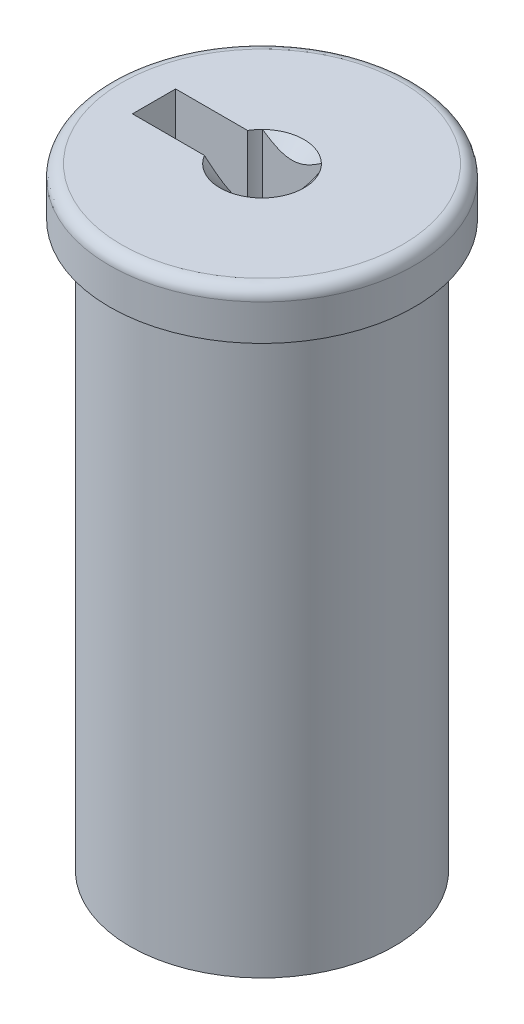
ISO-10303-21;
HEADER;
FILE_DESCRIPTION(('STEP AP214'),'2;1');
FILE_NAME('part.step','',(''),(''),'','','');
FILE_SCHEMA(('AUTOMOTIVE_DESIGN { 1 0 10303 214 1 1 1 1 }'));
ENDSEC;
DATA;
#1=APPLICATION_CONTEXT('core data for automotive mechanical design processes');
#2=APPLICATION_PROTOCOL_DEFINITION('international standard','automotive_design',2000,#1);
#3=PRODUCT_CONTEXT('',#1,'mechanical');
#4=PRODUCT('Part','Part','',(#3));
#5=PRODUCT_RELATED_PRODUCT_CATEGORY('part','',(#4));
#6=PRODUCT_DEFINITION_FORMATION('','',#4);
#7=PRODUCT_DEFINITION_CONTEXT('part definition',#1,'design');
#8=PRODUCT_DEFINITION('design','',#6,#7);
#9=PRODUCT_DEFINITION_SHAPE('','',#8);
#10=(LENGTH_UNIT() NAMED_UNIT(*) SI_UNIT(.MILLI.,.METRE.));
#11=(NAMED_UNIT(*) PLANE_ANGLE_UNIT() SI_UNIT($,.RADIAN.));
#12=(NAMED_UNIT(*) SI_UNIT($,.STERADIAN.) SOLID_ANGLE_UNIT());
#13=UNCERTAINTY_MEASURE_WITH_UNIT(LENGTH_MEASURE(1.E-05),#10,'distance_accuracy_value','');
#14=(GEOMETRIC_REPRESENTATION_CONTEXT(3) GLOBAL_UNCERTAINTY_ASSIGNED_CONTEXT((#13)) GLOBAL_UNIT_ASSIGNED_CONTEXT((#10,
#11,#12)) REPRESENTATION_CONTEXT('',''));
#15=CARTESIAN_POINT('',(0.,0.,0.));
#16=DIRECTION('',(0.,0.,1.));
#17=DIRECTION('',(1.,0.,0.));
#18=AXIS2_PLACEMENT_3D('',#15,#16,#17);
#19=CARTESIAN_POINT('',(0.,1.99685534591195,0.));
#20=DIRECTION('',(0.,1.,0.));
#21=DIRECTION('',(0.,0.,1.));
#22=AXIS2_PLACEMENT_3D('',#19,#20,#21);
#23=PLANE('',#22);
#24=CARTESIAN_POINT('',(0.,1.99685534591195,0.));
#25=DIRECTION('',(0.,1.,0.));
#26=DIRECTION('',(0.,0.,1.));
#27=AXIS2_PLACEMENT_3D('',#24,#25,#26);
#28=CIRCLE('',#27,1.75);
#29=CARTESIAN_POINT('',(1.22474487139159,1.99685534591195,-1.25));
#30=VERTEX_POINT('',#29);
#31=CARTESIAN_POINT('',(-1.22474487139159,1.99685534591195,-1.25));
#32=VERTEX_POINT('',#31);
#33=EDGE_CURVE('E265',#30,#32,#28,.T.);
#34=ORIENTED_EDGE('',*,*,#33,.F.);
#35=CARTESIAN_POINT('',(0.,1.99685534591195,0.));
#36=DIRECTION('',(0.,1.,0.));
#37=DIRECTION('',(0.,0.,1.));
#38=AXIS2_PLACEMENT_3D('',#35,#36,#37);
#39=CIRCLE('',#38,1.75);
#40=CARTESIAN_POINT('',(1.50083310198036,1.99685534591195,-0.9));
#41=VERTEX_POINT('',#40);
#42=EDGE_CURVE('E155',#41,#30,#39,.T.);
#43=ORIENTED_EDGE('',*,*,#42,.F.);
#44=CARTESIAN_POINT('',(1.50083310198036,1.99685534591195,0.899999999999998));
#45=VERTEX_POINT('',#44);
#46=EDGE_CURVE('E264',#45,#41,#28,.T.);
#47=ORIENTED_EDGE('',*,*,#46,.F.);
#48=CARTESIAN_POINT('',(-1.50083310198036,1.99685534591195,0.9));
#49=VERTEX_POINT('',#48);
#50=EDGE_CURVE('E266',#49,#45,#28,.T.);
#51=ORIENTED_EDGE('',*,*,#50,.F.);
#52=DIRECTION('',(-1.,0.,0.));
#53=VECTOR('',#52,1.);
#54=CARTESIAN_POINT('',(0.,1.99685534591195,0.899999999999999));
#55=LINE('',#54,#53);
#56=CARTESIAN_POINT('',(-4.49916689801964,1.99685534591195,0.900000000000001));
#57=VERTEX_POINT('',#56);
#58=EDGE_CURVE('E98',#49,#57,#55,.T.);
#59=ORIENTED_EDGE('',*,*,#58,.T.);
#60=DIRECTION('',(0.,0.,-1.));
#61=VECTOR('',#60,1.);
#62=CARTESIAN_POINT('',(-4.49916689801964,1.99685534591195,0.));
#63=LINE('',#62,#61);
#64=CARTESIAN_POINT('',(-4.49916689801964,1.99685534591195,-0.900000000000001));
#65=VERTEX_POINT('',#64);
#66=EDGE_CURVE('E160',#57,#65,#63,.T.);
#67=ORIENTED_EDGE('',*,*,#66,.T.);
#68=DIRECTION('',(1.,0.,0.));
#69=VECTOR('',#68,1.);
#70=CARTESIAN_POINT('',(0.,1.99685534591195,-0.899999999999998));
#71=LINE('',#70,#69);
#72=CARTESIAN_POINT('',(-1.50083310198036,1.99685534591195,-0.899999999999999));
#73=VERTEX_POINT('',#72);
#74=EDGE_CURVE('E140',#65,#73,#71,.T.);
#75=ORIENTED_EDGE('',*,*,#74,.T.);
#76=EDGE_CURVE('E158',#32,#73,#39,.T.);
#77=ORIENTED_EDGE('',*,*,#76,.F.);
#78=EDGE_LOOP('',(#34,#43,#47,#51,#59,#67,#75,#77));
#79=FACE_BOUND('',#78,.T.);
#80=CARTESIAN_POINT('',(0.,1.99685534591195,0.));
#81=DIRECTION('',(0.,1.,0.));
#82=DIRECTION('',(0.,0.,1.));
#83=AXIS2_PLACEMENT_3D('',#80,#81,#82);
#84=CIRCLE('',#83,5.85);
#85=CARTESIAN_POINT('',(0.,1.99685534591195,5.85));
#86=VERTEX_POINT('',#85);
#87=EDGE_CURVE('E69',#86,#86,#84,.T.);
#88=ORIENTED_EDGE('',*,*,#87,.T.);
#89=EDGE_LOOP('',(#88));
#90=FACE_BOUND('',#89,.T.);
#91=ADVANCED_FACE('F60',(#79,#90),#23,.T.);
#92=CARTESIAN_POINT('',(0.,0.,0.));
#93=DIRECTION('',(0.,1.,0.));
#94=DIRECTION('',(0.,0.,1.));
#95=AXIS2_PLACEMENT_3D('',#92,#93,#94);
#96=CYLINDRICAL_SURFACE('',#95,6.35);
#97=CARTESIAN_POINT('',(0.,1.49685534591195,0.));
#98=DIRECTION('',(0.,1.,0.));
#99=DIRECTION('',(0.,0.,1.));
#100=AXIS2_PLACEMENT_3D('',#97,#98,#99);
#101=CIRCLE('',#100,6.35);
#102=CARTESIAN_POINT('',(0.,1.49685534591195,6.35));
#103=VERTEX_POINT('',#102);
#104=EDGE_CURVE('E12',#103,#103,#101,.F.);
#105=ORIENTED_EDGE('',*,*,#104,.T.);
#106=EDGE_LOOP('',(#105));
#107=FACE_BOUND('',#106,.T.);
#108=CARTESIAN_POINT('',(0.,0.,0.));
#109=DIRECTION('',(0.,1.,0.));
#110=DIRECTION('',(0.,0.,1.));
#111=AXIS2_PLACEMENT_3D('',#108,#109,#110);
#112=CIRCLE('',#111,6.35);
#113=CARTESIAN_POINT('',(0.,0.,6.35));
#114=VERTEX_POINT('',#113);
#115=EDGE_CURVE('E179',#114,#114,#112,.T.);
#116=ORIENTED_EDGE('',*,*,#115,.T.);
#117=EDGE_LOOP('',(#116));
#118=FACE_BOUND('',#117,.T.);
#119=ADVANCED_FACE('F203',(#107,#118),#96,.T.);
#120=CARTESIAN_POINT('',(6.35,0.,0.));
#121=DIRECTION('',(0.,-1.,0.));
#122=DIRECTION('',(0.,0.,-1.));
#123=AXIS2_PLACEMENT_3D('',#120,#121,#122);
#124=PLANE('',#123);
#125=CARTESIAN_POINT('',(0.,0.,0.));
#126=DIRECTION('',(0.,-1.,0.));
#127=DIRECTION('',(0.,0.,-1.));
#128=AXIS2_PLACEMENT_3D('',#125,#126,#127);
#129=CIRCLE('',#128,5.5);
#130=CARTESIAN_POINT('',(0.,0.,-5.5));
#131=VERTEX_POINT('',#130);
#132=EDGE_CURVE('E180',#131,#131,#129,.T.);
#133=ORIENTED_EDGE('',*,*,#132,.F.);
#134=EDGE_LOOP('',(#133));
#135=FACE_BOUND('',#134,.T.);
#136=ORIENTED_EDGE('',*,*,#115,.F.);
#137=EDGE_LOOP('',(#136));
#138=FACE_BOUND('',#137,.T.);
#139=ADVANCED_FACE('F208',(#135,#138),#124,.T.);
#140=CARTESIAN_POINT('',(0.,-23.5,0.));
#141=DIRECTION('',(0.,1.,0.));
#142=DIRECTION('',(0.,0.,1.));
#143=AXIS2_PLACEMENT_3D('',#140,#141,#142);
#144=CYLINDRICAL_SURFACE('',#143,5.5);
#145=CARTESIAN_POINT('',(0.,-23.5,0.));
#146=DIRECTION('',(0.,-1.,0.));
#147=DIRECTION('',(0.,0.,-1.));
#148=AXIS2_PLACEMENT_3D('',#145,#146,#147);
#149=CIRCLE('',#148,5.5);
#150=CARTESIAN_POINT('',(0.,-23.5,-5.5));
#151=VERTEX_POINT('',#150);
#152=EDGE_CURVE('E167',#151,#151,#149,.T.);
#153=ORIENTED_EDGE('',*,*,#152,.F.);
#154=EDGE_LOOP('',(#153));
#155=FACE_BOUND('',#154,.T.);
#156=ORIENTED_EDGE('',*,*,#132,.T.);
#157=EDGE_LOOP('',(#156));
#158=FACE_BOUND('',#157,.T.);
#159=ADVANCED_FACE('F213',(#155,#158),#144,.T.);
#160=CARTESIAN_POINT('',(0.,-23.5,0.));
#161=DIRECTION('',(0.,-1.,0.));
#162=DIRECTION('',(0.,0.,-1.));
#163=AXIS2_PLACEMENT_3D('',#160,#161,#162);
#164=PLANE('',#163);
#165=ORIENTED_EDGE('',*,*,#152,.T.);
#166=EDGE_LOOP('',(#165));
#167=FACE_BOUND('',#166,.T.);
#168=ADVANCED_FACE('F220',(#167),#164,.T.);
#169=CARTESIAN_POINT('',(1.50083310198036,-8.00314465408805,0.));
#170=DIRECTION('',(-1.,0.,0.));
#171=DIRECTION('',(0.,0.,1.));
#172=AXIS2_PLACEMENT_3D('',#169,#170,#171);
#173=PLANE('',#172);
#174=CARTESIAN_POINT('',(1.50083310198036,2.58102767974036,-1.78769697768105));
#175=CARTESIAN_POINT('',(1.50083310198036,2.54789201782998,-1.74442569699751));
#176=CARTESIAN_POINT('',(1.50083310198036,2.5150635177435,-1.70091992350826));
#177=CARTESIAN_POINT('',(1.50083310198036,2.45014940518146,-1.61334201639202));
#178=CARTESIAN_POINT('',(1.50083310198036,2.41806397303119,-1.56926974924291));
#179=CARTESIAN_POINT('',(1.50083310198036,2.32265706334548,-1.43541233804854));
#180=CARTESIAN_POINT('',(1.50083310198036,2.26069396993077,-1.34464298655783));
#181=CARTESIAN_POINT('',(1.50083310198036,2.13849213576003,-1.15390873630126));
#182=CARTESIAN_POINT('',(1.50083310198036,2.07859583984592,-1.05372205666954));
#183=CARTESIAN_POINT('',(1.50083310198036,1.96864537543266,-0.848271443774003));
#184=CARTESIAN_POINT('',(1.50083310198036,1.9185579727457,-0.743026214468439));
#185=CARTESIAN_POINT('',(1.50083310198036,1.85726382496891,-0.585611147048519));
#186=CARTESIAN_POINT('',(1.50083310198036,1.83977595311796,-0.535899355739226));
#187=CARTESIAN_POINT('',(1.50083310198036,1.80878492898886,-0.435223564090527));
#188=CARTESIAN_POINT('',(1.50083310198036,1.79528203542052,-0.384259482683437));
#189=CARTESIAN_POINT('',(1.50083310198036,1.77320564443161,-0.28226476229586));
#190=CARTESIAN_POINT('',(1.50083310198036,1.76454393137995,-0.231253529087822));
#191=CARTESIAN_POINT('',(1.50083310198036,1.75232878444633,-0.128619538401874));
#192=CARTESIAN_POINT('',(1.50083310198036,1.74877433974499,-0.0769969039709247));
#193=CARTESIAN_POINT('',(1.50083310198036,1.74706636293139,0.0241843737507768));
#194=CARTESIAN_POINT('',(1.50083310198036,1.74869391000862,0.0737393704966389));
#195=CARTESIAN_POINT('',(1.50083310198036,1.75676224665262,0.172453125815203));
#196=CARTESIAN_POINT('',(1.50083310198036,1.76320348170739,0.221611847288537));
#197=CARTESIAN_POINT('',(1.50083310198036,1.7806472426943,0.320010772845203));
#198=CARTESIAN_POINT('',(1.50083310198036,1.79172954519245,0.369236609505007));
#199=CARTESIAN_POINT('',(1.50083310198036,1.81784861115949,0.466604319118156));
#200=CARTESIAN_POINT('',(1.50083310198036,1.83288512212274,0.51474626107321));
#201=CARTESIAN_POINT('',(1.50083310198036,1.88514037878449,0.66371562404398));
#202=CARTESIAN_POINT('',(1.50083310198036,1.92820030629378,0.762488201091973));
#203=CARTESIAN_POINT('',(1.50083310198036,2.02400555067697,0.955414306827815));
#204=CARTESIAN_POINT('',(1.50083310198036,2.07678515103549,1.04954994155055));
#205=CARTESIAN_POINT('',(1.50083310198036,2.18574561831869,1.22948936467362));
#206=CARTESIAN_POINT('',(1.50083310198036,2.24162987345261,1.31547504522854));
#207=CARTESIAN_POINT('',(1.50083310198036,2.32805239010938,1.44215687848311));
#208=CARTESIAN_POINT('',(1.50083310198036,2.3571707307896,1.48383880838493));
#209=CARTESIAN_POINT('',(1.50083310198036,2.41618573043119,1.56663130540246));
#210=CARTESIAN_POINT('',(1.50083310198036,2.44608217271215,1.60774202679509));
#211=CARTESIAN_POINT('',(1.50083310198036,2.47630150794565,1.64861462731798));
#212=B_SPLINE_CURVE_WITH_KNOTS('',3,(#174,#175,#176,#177,#178,#179,#180,#181,#182,#183,#184,
#185,#186,#187,#188,#189,#190,#191,#192,#193,#194,#195,#196,#197,#198,#199,#200,#201,#202,#203,
#204,#205,#206,#207,#208,#209,#210,#211),.UNSPECIFIED.,.F.,.F.,(4,2,2,2,2,2,2,2,2,2,2,2,2,2,2,2,
2,2,4),(0.,0.163499475188371,0.327038220710081,0.656606203121994,1.00651435366872,
1.3552156267395,1.51317749463113,1.67114961535181,1.82614058790741,1.98110088076134,
2.12960286469262,2.27811859360367,2.42929938332605,2.58047052137383,2.9027796464659,
3.22624819538202,3.53374535846932,3.6862757947348,3.83876420048568),.UNSPECIFIED.);
#213=EDGE_CURVE('E105',#41,#45,#212,.T.);
#214=ORIENTED_EDGE('',*,*,#213,.F.);
#215=DIRECTION('',(0.,1.,0.));
#216=VECTOR('',#215,1.);
#217=CARTESIAN_POINT('',(1.50083310198036,-8.00314465408805,-0.9));
#218=LINE('',#217,#216);
#219=CARTESIAN_POINT('',(1.50083310198036,-8.00314465408805,-0.9));
#220=VERTEX_POINT('',#219);
#221=EDGE_CURVE('E112',#220,#41,#218,.T.);
#222=ORIENTED_EDGE('',*,*,#221,.F.);
#223=DIRECTION('',(0.,0.,1.));
#224=VECTOR('',#223,1.);
#225=CARTESIAN_POINT('',(1.50083310198036,-8.00314465408805,0.));
#226=LINE('',#225,#224);
#227=CARTESIAN_POINT('',(1.50083310198036,-8.00314465408805,0.899999999999998));
#228=VERTEX_POINT('',#227);
#229=EDGE_CURVE('E163',#220,#228,#226,.T.);
#230=ORIENTED_EDGE('',*,*,#229,.T.);
#231=DIRECTION('',(0.,1.,0.));
#232=VECTOR('',#231,1.);
#233=CARTESIAN_POINT('',(1.50083310198036,-8.00314465408805,0.899999999999998));
#234=LINE('',#233,#232);
#235=EDGE_CURVE('E164',#228,#45,#234,.T.);
#236=ORIENTED_EDGE('',*,*,#235,.T.);
#237=EDGE_LOOP('',(#214,#222,#230,#236));
#238=FACE_BOUND('',#237,.T.);
#239=ADVANCED_FACE('F230',(#238),#173,.T.);
#240=CARTESIAN_POINT('',(0.,-8.00314465408805,0.899999999999999));
#241=DIRECTION('',(0.,0.,-1.));
#242=DIRECTION('',(-1.,0.,0.));
#243=AXIS2_PLACEMENT_3D('',#240,#241,#242);
#244=PLANE('',#243);
#245=CARTESIAN_POINT('',(-6.57315509084369,6.88133858489026,0.900000000000002));
#246=CARTESIAN_POINT('',(-6.39296646193386,6.70282093423535,0.900000000000002));
#247=CARTESIAN_POINT('',(-6.21271543673626,6.52436620026066,0.900000000000002));
#248=CARTESIAN_POINT('',(-5.85197899744231,6.16757599316444,0.900000000000002));
#249=CARTESIAN_POINT('',(-5.67149352604317,5.989240577985,0.900000000000002));
#250=CARTESIAN_POINT('',(-5.30919077447101,5.63170820979137,0.900000000000002));
#251=CARTESIAN_POINT('',(-5.12737210421338,5.4525126645303,0.900000000000002));
#252=CARTESIAN_POINT('',(-4.76347726788477,5.09450103057511,0.900000000000001));
#253=CARTESIAN_POINT('',(-4.58140120393365,4.91568483802606,0.900000000000001));
#254=CARTESIAN_POINT('',(-4.11999138147013,4.46362030270415,0.900000000000001));
#255=CARTESIAN_POINT('',(-3.84036961544061,4.19066504403834,0.900000000000001));
#256=CARTESIAN_POINT('',(-3.41936537995554,3.78251767913426,0.900000000000001));
#257=CARTESIAN_POINT('',(-3.27868447540995,3.64660227291807,0.900000000000001));
#258=CARTESIAN_POINT('',(-2.99665661438537,3.37550070157014,0.9));
#259=CARTESIAN_POINT('',(-2.8553097494113,3.24031444142851,0.9));
#260=CARTESIAN_POINT('',(-2.572338657503,2.97173229807433,0.9));
#261=CARTESIAN_POINT('',(-2.43071982792858,2.83833073201646,0.9));
#262=CARTESIAN_POINT('',(-2.14581021406694,2.57316677299582,0.9));
#263=CARTESIAN_POINT('',(-2.00251861875808,2.44140524508687,0.9));
#264=CARTESIAN_POINT('',(-1.7856380246076,2.24623934818881,0.9));
#265=CARTESIAN_POINT('',(-1.71310198659393,2.1816668918955,0.9));
#266=CARTESIAN_POINT('',(-1.56706055161221,2.05362986430545,0.9));
#267=CARTESIAN_POINT('',(-1.49355520402746,1.99016523694816,0.9));
#268=CARTESIAN_POINT('',(-1.34523585418588,1.86490450623271,0.9));
#269=CARTESIAN_POINT('',(-1.27042296988132,1.80310708236191,0.9));
#270=CARTESIAN_POINT('',(-1.11881598558048,1.68200174202239,0.9));
#271=CARTESIAN_POINT('',(-1.04202255834198,1.62269299771496,0.9));
#272=CARTESIAN_POINT('',(-0.937100025958579,1.54602220538873,0.9));
#273=CARTESIAN_POINT('',(-0.910317132139064,1.52681949950374,0.899999999999999));
#274=CARTESIAN_POINT('',(-0.856333348859317,1.48900417829755,0.899999999999999));
#275=CARTESIAN_POINT('',(-0.829132422838936,1.47039161502997,0.899999999999999));
#276=CARTESIAN_POINT('',(-0.774218853983337,1.43386576078477,0.899999999999999));
#277=CARTESIAN_POINT('',(-0.746505675462011,1.41595327089276,0.899999999999999));
#278=CARTESIAN_POINT('',(-0.690520730451304,1.3810257271415,0.899999999999999));
#279=CARTESIAN_POINT('',(-0.662248974388194,1.36401065655295,0.899999999999999));
#280=CARTESIAN_POINT('',(-0.577755552626147,1.31535693040516,0.899999999999999));
#281=CARTESIAN_POINT('',(-0.520620819703954,1.28526717973428,0.899999999999999));
#282=CARTESIAN_POINT('',(-0.403322819752172,1.23172593166158,0.899999999999999));
#283=CARTESIAN_POINT('',(-0.343167217811514,1.20825854309034,0.899999999999999));
#284=CARTESIAN_POINT('',(-0.25170095722509,1.18095718175573,0.899999999999999));
#285=CARTESIAN_POINT('',(-0.221551501800178,1.17324462888744,0.899999999999999));
#286=CARTESIAN_POINT('',(-0.16067039968198,1.16060018332509,0.899999999999999));
#287=CARTESIAN_POINT('',(-0.12993890891854,1.15566755647054,0.899999999999999));
#288=CARTESIAN_POINT('',(-0.0683220761982261,1.14892893283723,0.899999999999999));
#289=CARTESIAN_POINT('',(-0.0374388769606136,1.14710369748398,0.899999999999999));
#290=CARTESIAN_POINT('',(0.0243533139727129,1.14665455814704,0.899999999999999));
#291=CARTESIAN_POINT('',(0.0552623070364085,1.14803083637941,0.899999999999999));
#292=CARTESIAN_POINT('',(0.116630000607849,1.15386871497315,0.899999999999999));
#293=CARTESIAN_POINT('',(0.147090157112166,1.1583153369512,0.899999999999999));
#294=CARTESIAN_POINT('',(0.207476461280475,1.16998454207141,0.899999999999999));
#295=CARTESIAN_POINT('',(0.23740239270651,1.17720822376618,0.899999999999999));
#296=CARTESIAN_POINT('',(0.296808277915482,1.19410225825245,0.899999999999999));
#297=CARTESIAN_POINT('',(0.326282629357627,1.20379202134844,0.899999999999999));
#298=CARTESIAN_POINT('',(0.384486236917645,1.22516862344574,0.899999999999999));
#299=CARTESIAN_POINT('',(0.413215526087012,1.23685537368414,0.899999999999999));
#300=CARTESIAN_POINT('',(0.482225608632165,1.26725130175002,0.899999999999999));
#301=CARTESIAN_POINT('',(0.522129448569999,1.28681183516414,0.899999999999999));
#302=CARTESIAN_POINT('',(0.60065533898116,1.32837138266471,0.899999999999999));
#303=CARTESIAN_POINT('',(0.639276541340354,1.35037197004616,0.899999999999999));
#304=CARTESIAN_POINT('',(0.715513402840822,1.39621594620961,0.899999999999999));
#305=CARTESIAN_POINT('',(0.753126732607454,1.42006317879227,0.899999999999999));
#306=CARTESIAN_POINT('',(0.827461850055601,1.46911412073079,0.899999999999999));
#307=CARTESIAN_POINT('',(0.864183457195719,1.49431810151035,0.899999999999999));
#308=CARTESIAN_POINT('',(0.974032811632942,1.57200356142493,0.899999999999999));
#309=CARTESIAN_POINT('',(1.04604598961231,1.6260584872193,0.899999999999999));
#310=CARTESIAN_POINT('',(1.15251592258022,1.70898113569023,0.899999999999998));
#311=CARTESIAN_POINT('',(1.18772279994237,1.73690795888489,0.899999999999998));
#312=CARTESIAN_POINT('',(1.25771962102235,1.79327908451916,0.899999999999998));
#313=CARTESIAN_POINT('',(1.29250957916556,1.8217233689684,0.899999999999998));
#314=CARTESIAN_POINT('',(1.41370840695074,1.9220253579494,0.899999999999998));
#315=CARTESIAN_POINT('',(1.499220005796,1.99496522338703,0.899999999999998));
#316=CARTESIAN_POINT('',(1.66884499252095,2.14245728924254,0.899999999999998));
#317=CARTESIAN_POINT('',(1.75295823476831,2.21700965575742,0.899999999999998));
#318=CARTESIAN_POINT('',(1.92023320052476,2.36721876863208,0.899999999999998));
#319=CARTESIAN_POINT('',(2.00339465345349,2.4428758157766,0.899999999999998));
#320=CARTESIAN_POINT('',(2.16901685225235,2.59495390760375,0.899999999999998));
#321=CARTESIAN_POINT('',(2.25147758623553,2.67137496519931,0.899999999999998));
#322=CARTESIAN_POINT('',(2.49835570996222,2.90170535726278,0.899999999999998));
#323=CARTESIAN_POINT('',(2.66200249935262,3.05643982327839,0.899999999999998));
#324=CARTESIAN_POINT('',(2.98806849591008,3.3671361476661,0.899999999999997));
#325=CARTESIAN_POINT('',(3.15048790691234,3.52309779304553,0.899999999999997));
#326=CARTESIAN_POINT('',(3.45774490482279,3.81960701977633,0.899999999999997));
#327=CARTESIAN_POINT('',(3.60265881351494,3.96007555529843,0.899999999999997));
#328=CARTESIAN_POINT('',(3.89205531203423,4.24147139732623,0.899999999999997));
#329=CARTESIAN_POINT('',(4.0365378782158,4.38239872812825,0.899999999999997));
#330=CARTESIAN_POINT('',(4.32483102020073,4.66423484815764,0.899999999999997));
#331=CARTESIAN_POINT('',(4.4686423753174,4.80514284058749,0.899999999999997));
#332=CARTESIAN_POINT('',(4.7560128876874,5.0871988535272,0.899999999999996));
#333=CARTESIAN_POINT('',(4.89957205932559,5.22834685937858,0.899999999999996));
#334=CARTESIAN_POINT('',(5.04304633930763,5.36958082951967,0.899999999999996));
#335=B_SPLINE_CURVE_WITH_KNOTS('',3,(#245,#246,#247,#248,#249,#250,#251,#252,#253,#254,#255,
#256,#257,#258,#259,#260,#261,#262,#263,#264,#265,#266,#267,#268,#269,#270,#271,#272,#273,#274,
#275,#276,#277,#278,#279,#280,#281,#282,#283,#284,#285,#286,#287,#288,#289,#290,#291,#292,#293,
#294,#295,#296,#297,#298,#299,#300,#301,#302,#303,#304,#305,#306,#307,#308,#309,#310,#311,#312,
#313,#314,#315,#316,#317,#318,#319,#320,#321,#322,#323,#324,#325,#326,#327,#328,#329,#330,#331,
#332,#333,#334),.UNSPECIFIED.,.F.,.F.,(4,2,2,2,2,2,2,2,2,2,2,2,2,2,2,2,2,2,2,2,2,2,2,2,2,2,2,2,
2,2,2,2,2,2,2,2,2,2,2,2,2,2,2,2,4),(0.,0.76093922292564,1.5221268271165,2.28797342864384,
3.05357270308886,4.2258443857051,4.81267943022611,5.39943606577534,5.98309715845475,
6.56705406939091,6.85838828417506,7.14970771329745,7.44078919206879,7.73177306473653,
7.83063336542205,7.9295023619721,8.02848136486329,8.12745852197879,8.32093814443048,
8.513949462335,8.60720224225184,8.7004303831578,8.79307919944904,8.88573328903237,
8.97793853859962,9.07018030042397,9.16317184248954,9.25615925230315,9.38935662529116,
9.52264038596606,9.6562094470266,9.78980532921916,10.0598203679115,10.1946338793252,
10.3294427126556,10.6665879826141,11.0037681474626,11.3410418989454,11.6783213605366,
12.3539603468712,13.029484546287,13.6349440787367,14.2404362135936,14.8444482230821,
15.448424580975),.UNSPECIFIED.);
#336=EDGE_CURVE('E249',#45,#49,#335,.F.);
#337=ORIENTED_EDGE('',*,*,#336,.F.);
#338=ORIENTED_EDGE('',*,*,#235,.F.);
#339=DIRECTION('',(-1.,0.,0.));
#340=VECTOR('',#339,1.);
#341=CARTESIAN_POINT('',(0.,-8.00314465408805,0.899999999999999));
#342=LINE('',#341,#340);
#343=CARTESIAN_POINT('',(-4.49916689801964,-8.00314465408805,0.900000000000001));
#344=VERTEX_POINT('',#343);
#345=EDGE_CURVE('E77',#228,#344,#342,.T.);
#346=ORIENTED_EDGE('',*,*,#345,.T.);
#347=DIRECTION('',(0.,1.,0.));
#348=VECTOR('',#347,1.);
#349=CARTESIAN_POINT('',(-4.49916689801964,-8.00314465408805,0.900000000000001));
#350=LINE('',#349,#348);
#351=EDGE_CURVE('E132',#344,#57,#350,.T.);
#352=ORIENTED_EDGE('',*,*,#351,.T.);
#353=ORIENTED_EDGE('',*,*,#58,.F.);
#354=EDGE_LOOP('',(#337,#338,#346,#352,#353));
#355=FACE_BOUND('',#354,.T.);
#356=ADVANCED_FACE('F236',(#355),#244,.T.);
#357=CARTESIAN_POINT('',(-4.49916689801964,-8.00314465408805,0.));
#358=DIRECTION('',(1.,0.,0.));
#359=DIRECTION('',(0.,0.,-1.));
#360=AXIS2_PLACEMENT_3D('',#357,#358,#359);
#361=PLANE('',#360);
#362=ORIENTED_EDGE('',*,*,#66,.F.);
#363=ORIENTED_EDGE('',*,*,#351,.F.);
#364=DIRECTION('',(0.,0.,-1.));
#365=VECTOR('',#364,1.);
#366=CARTESIAN_POINT('',(-4.49916689801964,-8.00314465408805,0.));
#367=LINE('',#366,#365);
#368=CARTESIAN_POINT('',(-4.49916689801964,-8.00314465408805,-0.900000000000001));
#369=VERTEX_POINT('',#368);
#370=EDGE_CURVE('E126',#344,#369,#367,.T.);
#371=ORIENTED_EDGE('',*,*,#370,.T.);
#372=DIRECTION('',(0.,1.,0.));
#373=VECTOR('',#372,1.);
#374=CARTESIAN_POINT('',(-4.49916689801964,-8.00314465408805,-0.900000000000001));
#375=LINE('',#374,#373);
#376=EDGE_CURVE('E130',#369,#65,#375,.T.);
#377=ORIENTED_EDGE('',*,*,#376,.T.);
#378=EDGE_LOOP('',(#362,#363,#371,#377));
#379=FACE_BOUND('',#378,.T.);
#380=ADVANCED_FACE('F129',(#379),#361,.T.);
#381=CARTESIAN_POINT('',(0.,-8.00314465408805,-0.899999999999998));
#382=DIRECTION('',(0.,0.,1.));
#383=DIRECTION('',(1.,0.,0.));
#384=AXIS2_PLACEMENT_3D('',#381,#382,#383);
#385=PLANE('',#384);
#386=ORIENTED_EDGE('',*,*,#74,.F.);
#387=ORIENTED_EDGE('',*,*,#376,.F.);
#388=DIRECTION('',(1.,0.,0.));
#389=VECTOR('',#388,1.);
#390=CARTESIAN_POINT('',(0.,-8.00314465408805,-0.899999999999998));
#391=LINE('',#390,#389);
#392=CARTESIAN_POINT('',(-1.50083310198036,-8.00314465408805,-0.899999999999999));
#393=VERTEX_POINT('',#392);
#394=EDGE_CURVE('E134',#369,#393,#391,.T.);
#395=ORIENTED_EDGE('',*,*,#394,.T.);
#396=DIRECTION('',(0.,1.,0.));
#397=VECTOR('',#396,1.);
#398=CARTESIAN_POINT('',(-1.50083310198036,-8.00314465408805,-0.899999999999999));
#399=LINE('',#398,#397);
#400=EDGE_CURVE('E141',#393,#73,#399,.T.);
#401=ORIENTED_EDGE('',*,*,#400,.T.);
#402=EDGE_LOOP('',(#386,#387,#395,#401));
#403=FACE_BOUND('',#402,.T.);
#404=ADVANCED_FACE('F137',(#403),#385,.T.);
#405=CARTESIAN_POINT('',(0.,-8.00314465408805,0.));
#406=DIRECTION('',(0.,1.,0.));
#407=DIRECTION('',(0.,0.,1.));
#408=AXIS2_PLACEMENT_3D('',#405,#406,#407);
#409=CYLINDRICAL_SURFACE('',#408,1.75);
#410=ORIENTED_EDGE('',*,*,#76,.T.);
#411=ORIENTED_EDGE('',*,*,#400,.F.);
#412=CARTESIAN_POINT('',(0.,-8.00314465408805,0.));
#413=DIRECTION('',(0.,1.,0.));
#414=DIRECTION('',(0.,0.,1.));
#415=AXIS2_PLACEMENT_3D('',#412,#413,#414);
#416=CIRCLE('',#415,1.75);
#417=CARTESIAN_POINT('',(-1.22474487139159,-8.00314465408805,-1.25));
#418=VERTEX_POINT('',#417);
#419=EDGE_CURVE('E147',#418,#393,#416,.T.);
#420=ORIENTED_EDGE('',*,*,#419,.F.);
#421=DIRECTION('',(0.,1.,0.));
#422=VECTOR('',#421,1.);
#423=CARTESIAN_POINT('',(-1.22474487139159,-8.00314465408805,-1.25));
#424=LINE('',#423,#422);
#425=EDGE_CURVE('E170',#418,#32,#424,.T.);
#426=ORIENTED_EDGE('',*,*,#425,.T.);
#427=EDGE_LOOP('',(#410,#411,#420,#426));
#428=FACE_BOUND('',#427,.T.);
#429=ADVANCED_FACE('F286',(#428),#409,.F.);
#430=CARTESIAN_POINT('',(0.,-8.00314465408805,-1.25));
#431=DIRECTION('',(0.,0.,1.));
#432=DIRECTION('',(1.,0.,0.));
#433=AXIS2_PLACEMENT_3D('',#430,#431,#432);
#434=PLANE('',#433);
#435=CARTESIAN_POINT('',(-2.35321018204686,2.91145628430573,-1.25));
#436=CARTESIAN_POINT('',(-2.29807922949622,2.86277627811259,-1.25));
#437=CARTESIAN_POINT('',(-2.24276827916401,2.81429802892987,-1.25));
#438=CARTESIAN_POINT('',(-2.13169018252009,2.71785357536766,-1.25));
#439=CARTESIAN_POINT('',(-2.07592298126575,2.66988743430932,-1.25));
#440=CARTESIAN_POINT('',(-1.96356598968804,2.57434650718679,-1.25));
#441=CARTESIAN_POINT('',(-1.90697346452426,2.52677493077839,-1.25));
#442=CARTESIAN_POINT('',(-1.79312365272249,2.43243894398381,-1.25));
#443=CARTESIAN_POINT('',(-1.73586640328186,2.38567448879258,-1.25));
#444=CARTESIAN_POINT('',(-1.61677572046457,2.29016531946267,-1.25));
#445=CARTESIAN_POINT('',(-1.55488680721532,2.24148955437009,-1.25));
#446=CARTESIAN_POINT('',(-1.42992204370558,2.14568795712383,-1.25));
#447=CARTESIAN_POINT('',(-1.36684628322195,2.09856200847227,-1.25));
#448=CARTESIAN_POINT('',(-1.23929295369989,2.00651431458194,-1.25));
#449=CARTESIAN_POINT('',(-1.17481849027293,1.96158828899798,-1.25));
#450=CARTESIAN_POINT('',(-1.04391732496589,1.87469455888128,-1.25));
#451=CARTESIAN_POINT('',(-0.977491464502385,1.8327256050757,-1.25));
#452=CARTESIAN_POINT('',(-0.863426728364161,1.76560691638484,-1.25));
#453=CARTESIAN_POINT('',(-0.816458925130515,1.73932260706329,-1.25));
#454=CARTESIAN_POINT('',(-0.721116399229544,1.68937324169773,-1.25));
#455=CARTESIAN_POINT('',(-0.672741259520127,1.66570897225371,-1.25));
#456=CARTESIAN_POINT('',(-0.574903199932051,1.62203402253969,-1.25));
#457=CARTESIAN_POINT('',(-0.525455074212809,1.60199061840243,-1.25));
#458=CARTESIAN_POINT('',(-0.424993104682069,1.56629512990196,-1.25));
#459=CARTESIAN_POINT('',(-0.373980248347343,1.55064033673437,-1.25));
#460=CARTESIAN_POINT('',(-0.285872115516442,1.52864303637531,-1.25));
#461=CARTESIAN_POINT('',(-0.249123098155249,1.52091571379121,-1.25));
#462=CARTESIAN_POINT('',(-0.175115107147011,1.50853511728941,-1.25));
#463=CARTESIAN_POINT('',(-0.13785631800875,1.5038807596824,-1.25));
#464=CARTESIAN_POINT('',(-0.063140540525055,1.49789686178829,-1.25));
#465=CARTESIAN_POINT('',(-0.0256840851086413,1.4965608100161,-1.25));
#466=CARTESIAN_POINT('',(0.0491900553821707,1.49726038539527,-1.25));
#467=CARTESIAN_POINT('',(0.086607738640957,1.49929616388255,-1.25));
#468=CARTESIAN_POINT('',(0.19805309684084,1.51030752124408,-1.25));
#469=CARTESIAN_POINT('',(0.27164234290487,1.52415895363261,-1.25));
#470=CARTESIAN_POINT('',(0.379891973960082,1.55283329646437,-1.25));
#471=CARTESIAN_POINT('',(0.415695500414537,1.56374020721542,-1.25));
#472=CARTESIAN_POINT('',(0.486546686979649,1.58779684526157,-1.25));
#473=CARTESIAN_POINT('',(0.521594383219895,1.60094646508362,-1.25));
#474=CARTESIAN_POINT('',(0.606172998544615,1.63532883788625,-1.25));
#475=CARTESIAN_POINT('',(0.655290006249108,1.65757212676873,-1.25));
#476=CARTESIAN_POINT('',(0.75206743039363,1.70505037280935,-1.25));
#477=CARTESIAN_POINT('',(0.799726987372082,1.7302870539599,-1.25));
#478=CARTESIAN_POINT('',(0.940976309889746,1.8094826022665,-1.25));
#479=CARTESIAN_POINT('',(1.03264747995523,1.86684356681409,-1.25));
#480=CARTESIAN_POINT('',(1.21359908486521,1.98776338194114,-1.25));
#481=CARTESIAN_POINT('',(1.3028265332899,2.05139918078108,-1.25));
#482=CARTESIAN_POINT('',(1.43463731818892,2.14944207311528,-1.25));
#483=CARTESIAN_POINT('',(1.47820881725024,2.18253273185012,-1.25));
#484=CARTESIAN_POINT('',(1.56479295565305,2.2494338923589,-1.25));
#485=CARTESIAN_POINT('',(1.60780561444224,2.28324436897448,-1.25));
#486=CARTESIAN_POINT('',(1.75024032699816,2.39678577811949,-1.25));
#487=CARTESIAN_POINT('',(1.84863290407438,2.47780717948751,-1.25));
#488=CARTESIAN_POINT('',(2.04367655044224,2.64192479305551,-1.25));
#489=CARTESIAN_POINT('',(2.14032741688869,2.725021244268,-1.25));
#490=CARTESIAN_POINT('',(2.33240066023915,2.89268168525181,-1.25));
#491=CARTESIAN_POINT('',(2.42782262739802,2.97724614349962,-1.25));
#492=CARTESIAN_POINT('',(2.61773335902493,3.14741786123809,-1.25));
#493=CARTESIAN_POINT('',(2.71222210285508,3.23302514369735,-1.25));
#494=CARTESIAN_POINT('',(2.99496867014361,3.49129462633202,-1.25));
#495=CARTESIAN_POINT('',(3.18217278943392,3.66510916104891,-1.25));
#496=CARTESIAN_POINT('',(3.55483879700522,4.01451310003492,-1.25));
#497=CARTESIAN_POINT('',(3.74030102397159,4.19010214489084,-1.25));
#498=CARTESIAN_POINT('',(4.08945633625581,4.52279701596759,-1.25));
#499=CARTESIAN_POINT('',(4.25326841506078,4.67977806016429,-1.25));
#500=CARTESIAN_POINT('',(4.5802619308539,4.99441510109445,-1.25));
#501=CARTESIAN_POINT('',(4.74344332822535,5.15207113895796,-1.25));
#502=CARTESIAN_POINT('',(5.06886363766663,5.46741695577619,-1.25));
#503=CARTESIAN_POINT('',(5.2311039105983,5.62510533126024,-1.25));
#504=CARTESIAN_POINT('',(5.55520770517711,5.94084624779609,-1.25));
#505=CARTESIAN_POINT('',(5.71707125235054,6.09889876263961,-1.25));
#506=CARTESIAN_POINT('',(5.87880474291147,6.25708372803506,-1.25));
#507=B_SPLINE_CURVE_WITH_KNOTS('',3,(#435,#436,#437,#438,#439,#440,#441,#442,#443,#444,#445,
#446,#447,#448,#449,#450,#451,#452,#453,#454,#455,#456,#457,#458,#459,#460,#461,#462,#463,#464,
#465,#466,#467,#468,#469,#470,#471,#472,#473,#474,#475,#476,#477,#478,#479,#480,#481,#482,#483,
#484,#485,#486,#487,#488,#489,#490,#491,#492,#493,#494,#495,#496,#497,#498,#499,#500,#501,#502,
#503,#504,#505,#506),.UNSPECIFIED.,.F.,.F.,(4,2,2,2,2,2,2,2,2,2,2,2,2,2,2,2,2,2,2,2,2,2,2,2,2,2,
2,2,2,2,2,2,2,2,2,4),(0.,0.220642645307009,0.44131226382185,0.663098796164283,0.884872976798632,
1.12106713385635,1.35724349570464,1.59294041794375,1.8285371608252,1.9899427300882,
2.1513966265931,2.31130912596501,2.47112270332258,2.58366760441987,2.69617279502726,
2.80845704255087,2.92074632980086,3.14422971745468,3.25646389331423,3.36869269230075,
3.53031104866354,3.69202294245778,4.01606409884919,4.344742473796,4.50887329779977,
4.67299839464927,5.05532177979417,5.43768940746823,5.82018138672812,6.20268180580832,
6.96902001117692,7.73520599329622,8.41586250392891,9.09656109733803,9.77530026622966,
10.4539920217655),.UNSPECIFIED.);
#508=EDGE_CURVE('E258',#32,#30,#507,.T.);
#509=ORIENTED_EDGE('',*,*,#508,.F.);
#510=ORIENTED_EDGE('',*,*,#425,.F.);
#511=DIRECTION('',(1.,0.,0.));
#512=VECTOR('',#511,1.);
#513=CARTESIAN_POINT('',(0.,-8.00314465408805,-1.25));
#514=LINE('',#513,#512);
#515=CARTESIAN_POINT('',(1.22474487139159,-8.00314465408805,-1.25));
#516=VERTEX_POINT('',#515);
#517=EDGE_CURVE('E149',#418,#516,#514,.T.);
#518=ORIENTED_EDGE('',*,*,#517,.T.);
#519=DIRECTION('',(0.,1.,0.));
#520=VECTOR('',#519,1.);
#521=CARTESIAN_POINT('',(1.22474487139159,-8.00314465408805,-1.25));
#522=LINE('',#521,#520);
#523=EDGE_CURVE('E173',#516,#30,#522,.T.);
#524=ORIENTED_EDGE('',*,*,#523,.T.);
#525=EDGE_LOOP('',(#509,#510,#518,#524));
#526=FACE_BOUND('',#525,.T.);
#527=ADVANCED_FACE('F240',(#526),#434,.T.);
#528=ORIENTED_EDGE('',*,*,#42,.T.);
#529=ORIENTED_EDGE('',*,*,#523,.F.);
#530=EDGE_CURVE('E151',#220,#516,#416,.T.);
#531=ORIENTED_EDGE('',*,*,#530,.F.);
#532=ORIENTED_EDGE('',*,*,#221,.T.);
#533=EDGE_LOOP('',(#528,#529,#531,#532));
#534=FACE_BOUND('',#533,.T.);
#535=ADVANCED_FACE('F199',(#534),#409,.F.);
#536=CARTESIAN_POINT('',(0.,-8.00314465408805,0.));
#537=DIRECTION('',(0.,1.,0.));
#538=DIRECTION('',(0.,0.,1.));
#539=AXIS2_PLACEMENT_3D('',#536,#537,#538);
#540=PLANE('',#539);
#541=ORIENTED_EDGE('',*,*,#229,.F.);
#542=ORIENTED_EDGE('',*,*,#530,.T.);
#543=ORIENTED_EDGE('',*,*,#517,.F.);
#544=ORIENTED_EDGE('',*,*,#419,.T.);
#545=ORIENTED_EDGE('',*,*,#394,.F.);
#546=ORIENTED_EDGE('',*,*,#370,.F.);
#547=ORIENTED_EDGE('',*,*,#345,.F.);
#548=EDGE_LOOP('',(#541,#542,#543,#544,#545,#546,#547));
#549=FACE_BOUND('',#548,.T.);
#550=ADVANCED_FACE('F144',(#549),#540,.T.);
#551=CARTESIAN_POINT('',(0.,1.49685534591195,0.));
#552=DIRECTION('',(0.,1.,0.));
#553=DIRECTION('',(0.,0.,1.));
#554=AXIS2_PLACEMENT_3D('',#551,#552,#553);
#555=TOROIDAL_SURFACE('',#554,5.85,0.5);
#556=ORIENTED_EDGE('',*,*,#104,.F.);
#557=EDGE_LOOP('',(#556));
#558=FACE_BOUND('',#557,.T.);
#559=ORIENTED_EDGE('',*,*,#87,.F.);
#560=EDGE_LOOP('',(#559));
#561=FACE_BOUND('',#560,.T.);
#562=ADVANCED_FACE('F62',(#558,#561),#555,.T.);
#563=CARTESIAN_POINT('',(0.,1.99685534591195,0.));
#564=DIRECTION('',(0.,1.,0.));
#565=DIRECTION('',(0.,0.,1.));
#566=AXIS2_PLACEMENT_3D('',#563,#564,#565);
#567=CONICAL_SURFACE('',#566,1.75,0.78539816339745);
#568=ORIENTED_EDGE('',*,*,#508,.T.);
#569=ORIENTED_EDGE('',*,*,#33,.T.);
#570=EDGE_LOOP('',(#568,#569));
#571=FACE_BOUND('',#570,.T.);
#572=ADVANCED_FACE('F189',(#571),#567,.F.);
#573=ORIENTED_EDGE('',*,*,#336,.T.);
#574=ORIENTED_EDGE('',*,*,#50,.T.);
#575=EDGE_LOOP('',(#573,#574));
#576=FACE_BOUND('',#575,.T.);
#577=ADVANCED_FACE('F195',(#576),#567,.F.);
#578=ORIENTED_EDGE('',*,*,#213,.T.);
#579=ORIENTED_EDGE('',*,*,#46,.T.);
#580=EDGE_LOOP('',(#578,#579));
#581=FACE_BOUND('',#580,.T.);
#582=ADVANCED_FACE('F198',(#581),#567,.F.);
#583=CLOSED_SHELL('',(#91,#119,#139,#159,#168,#239,#356,#380,#404,#429,#527,#535,#550,#562,#572,
#577,#582));
#584=MANIFOLD_SOLID_BREP('B2',#583);
#585=ADVANCED_BREP_SHAPE_REPRESENTATION('',(#18,#584),#14);
#586=SHAPE_DEFINITION_REPRESENTATION(#9,#585);
ENDSEC;
END-ISO-10303-21;
